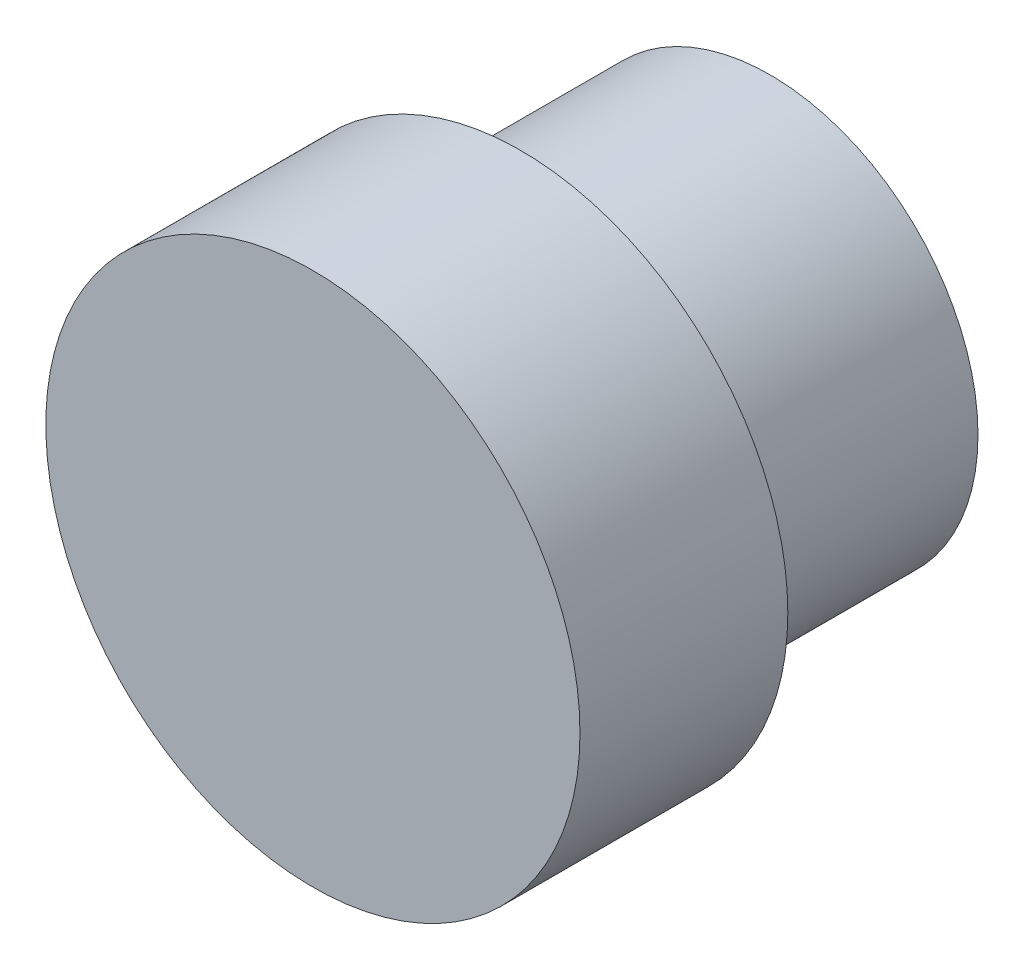
ISO-10303-21;
HEADER;
FILE_DESCRIPTION(('STEP AP214'),'2;1');
FILE_NAME('part.step','',(''),(''),'','','');
FILE_SCHEMA(('AUTOMOTIVE_DESIGN { 1 0 10303 214 1 1 1 1 }'));
ENDSEC;
DATA;
#1=APPLICATION_CONTEXT('core data for automotive mechanical design processes');
#2=APPLICATION_PROTOCOL_DEFINITION('international standard','automotive_design',2000,#1);
#3=PRODUCT_CONTEXT('',#1,'mechanical');
#4=PRODUCT('Part','Part','',(#3));
#5=PRODUCT_RELATED_PRODUCT_CATEGORY('part','',(#4));
#6=PRODUCT_DEFINITION_FORMATION('','',#4);
#7=PRODUCT_DEFINITION_CONTEXT('part definition',#1,'design');
#8=PRODUCT_DEFINITION('design','',#6,#7);
#9=PRODUCT_DEFINITION_SHAPE('','',#8);
#10=(LENGTH_UNIT() NAMED_UNIT(*) SI_UNIT(.MILLI.,.METRE.));
#11=(NAMED_UNIT(*) PLANE_ANGLE_UNIT() SI_UNIT($,.RADIAN.));
#12=(NAMED_UNIT(*) SI_UNIT($,.STERADIAN.) SOLID_ANGLE_UNIT());
#13=UNCERTAINTY_MEASURE_WITH_UNIT(LENGTH_MEASURE(1.E-05),#10,'distance_accuracy_value','');
#14=(GEOMETRIC_REPRESENTATION_CONTEXT(3) GLOBAL_UNCERTAINTY_ASSIGNED_CONTEXT((#13)) GLOBAL_UNIT_ASSIGNED_CONTEXT((#10,
#11,#12)) REPRESENTATION_CONTEXT('',''));
#15=CARTESIAN_POINT('',(0.,0.,0.));
#16=DIRECTION('',(0.,0.,1.));
#17=DIRECTION('',(1.,0.,0.));
#18=AXIS2_PLACEMENT_3D('',#15,#16,#17);
#19=CARTESIAN_POINT('',(15.,15.,6.));
#20=DIRECTION('',(0.,0.,-1.));
#21=DIRECTION('',(-1.,0.,0.));
#22=AXIS2_PLACEMENT_3D('',#19,#20,#21);
#23=CYLINDRICAL_SURFACE('',#22,5.);
#24=CARTESIAN_POINT('',(15.,15.,6.));
#25=DIRECTION('',(0.,0.,1.));
#26=DIRECTION('',(1.,0.,0.));
#27=AXIS2_PLACEMENT_3D('',#24,#25,#26);
#28=CIRCLE('',#27,5.);
#29=CARTESIAN_POINT('',(20.,15.,6.));
#30=VERTEX_POINT('',#29);
#31=EDGE_CURVE('E10',#30,#30,#28,.T.);
#32=ORIENTED_EDGE('',*,*,#31,.F.);
#33=EDGE_LOOP('',(#32));
#34=FACE_BOUND('',#33,.T.);
#35=CARTESIAN_POINT('',(15.,15.,0.));
#36=DIRECTION('',(0.,0.,1.));
#37=DIRECTION('',(1.,0.,0.));
#38=AXIS2_PLACEMENT_3D('',#35,#36,#37);
#39=CIRCLE('',#38,5.);
#40=CARTESIAN_POINT('',(20.,15.,0.));
#41=VERTEX_POINT('',#40);
#42=EDGE_CURVE('E34',#41,#41,#39,.T.);
#43=ORIENTED_EDGE('',*,*,#42,.T.);
#44=EDGE_LOOP('',(#43));
#45=FACE_BOUND('',#44,.T.);
#46=ADVANCED_FACE('F31',(#34,#45),#23,.T.);
#47=CARTESIAN_POINT('',(15.,15.,0.));
#48=DIRECTION('',(0.,0.,1.));
#49=DIRECTION('',(1.,0.,0.));
#50=AXIS2_PLACEMENT_3D('',#47,#48,#49);
#51=PLANE('',#50);
#52=ORIENTED_EDGE('',*,*,#42,.F.);
#53=EDGE_LOOP('',(#52));
#54=FACE_BOUND('',#53,.T.);
#55=ADVANCED_FACE('F54',(#54),#51,.F.);
#56=CARTESIAN_POINT('',(15.,15.,11.));
#57=DIRECTION('',(0.,0.,-1.));
#58=DIRECTION('',(-1.,0.,0.));
#59=AXIS2_PLACEMENT_3D('',#56,#57,#58);
#60=CYLINDRICAL_SURFACE('',#59,6.425);
#61=CARTESIAN_POINT('',(15.,15.,11.));
#62=DIRECTION('',(0.,0.,1.));
#63=DIRECTION('',(1.,0.,0.));
#64=AXIS2_PLACEMENT_3D('',#61,#62,#63);
#65=CIRCLE('',#64,6.425);
#66=CARTESIAN_POINT('',(21.425,15.,11.));
#67=VERTEX_POINT('',#66);
#68=EDGE_CURVE('E41',#67,#67,#65,.T.);
#69=ORIENTED_EDGE('',*,*,#68,.F.);
#70=EDGE_LOOP('',(#69));
#71=FACE_BOUND('',#70,.T.);
#72=CARTESIAN_POINT('',(15.,15.,6.));
#73=DIRECTION('',(0.,0.,1.));
#74=DIRECTION('',(1.,0.,0.));
#75=AXIS2_PLACEMENT_3D('',#72,#73,#74);
#76=CIRCLE('',#75,6.425);
#77=CARTESIAN_POINT('',(21.425,15.,6.));
#78=VERTEX_POINT('',#77);
#79=EDGE_CURVE('E43',#78,#78,#76,.T.);
#80=ORIENTED_EDGE('',*,*,#79,.T.);
#81=EDGE_LOOP('',(#80));
#82=FACE_BOUND('',#81,.T.);
#83=ADVANCED_FACE('F51',(#71,#82),#60,.T.);
#84=CARTESIAN_POINT('',(15.,15.,11.));
#85=DIRECTION('',(0.,0.,1.));
#86=DIRECTION('',(1.,0.,0.));
#87=AXIS2_PLACEMENT_3D('',#84,#85,#86);
#88=PLANE('',#87);
#89=ORIENTED_EDGE('',*,*,#68,.T.);
#90=EDGE_LOOP('',(#89));
#91=FACE_BOUND('',#90,.T.);
#92=ADVANCED_FACE('F49',(#91),#88,.T.);
#93=CARTESIAN_POINT('',(15.,15.,6.));
#94=DIRECTION('',(0.,0.,1.));
#95=DIRECTION('',(1.,0.,0.));
#96=AXIS2_PLACEMENT_3D('',#93,#94,#95);
#97=PLANE('',#96);
#98=ORIENTED_EDGE('',*,*,#31,.T.);
#99=EDGE_LOOP('',(#98));
#100=FACE_BOUND('',#99,.T.);
#101=ORIENTED_EDGE('',*,*,#79,.F.);
#102=EDGE_LOOP('',(#101));
#103=FACE_BOUND('',#102,.T.);
#104=ADVANCED_FACE('F58',(#100,#103),#97,.F.);
#105=CLOSED_SHELL('',(#46,#55,#83,#92,#104));
#106=MANIFOLD_SOLID_BREP('B2',#105);
#107=ADVANCED_BREP_SHAPE_REPRESENTATION('',(#18,#106),#14);
#108=SHAPE_DEFINITION_REPRESENTATION(#9,#107);
ENDSEC;
END-ISO-10303-21;
